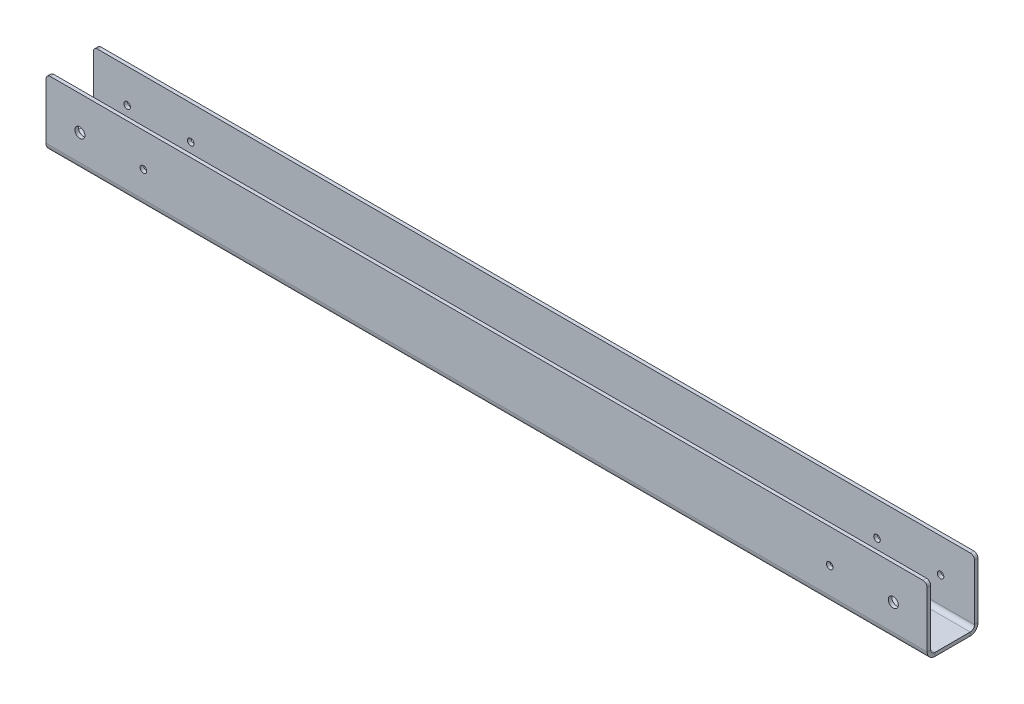
ISO-10303-21;
HEADER;
FILE_DESCRIPTION(('STEP AP214'),'2;1');
FILE_NAME('part.step','',(''),(''),'','','');
FILE_SCHEMA(('AUTOMOTIVE_DESIGN { 1 0 10303 214 1 1 1 1 }'));
ENDSEC;
DATA;
#1=APPLICATION_CONTEXT('core data for automotive mechanical design processes');
#2=APPLICATION_PROTOCOL_DEFINITION('international standard','automotive_design',2000,#1);
#3=PRODUCT_CONTEXT('',#1,'mechanical');
#4=PRODUCT('Part','Part','',(#3));
#5=PRODUCT_RELATED_PRODUCT_CATEGORY('part','',(#4));
#6=PRODUCT_DEFINITION_FORMATION('','',#4);
#7=PRODUCT_DEFINITION_CONTEXT('part definition',#1,'design');
#8=PRODUCT_DEFINITION('design','',#6,#7);
#9=PRODUCT_DEFINITION_SHAPE('','',#8);
#10=(LENGTH_UNIT() NAMED_UNIT(*) SI_UNIT(.MILLI.,.METRE.));
#11=(NAMED_UNIT(*) PLANE_ANGLE_UNIT() SI_UNIT($,.RADIAN.));
#12=(NAMED_UNIT(*) SI_UNIT($,.STERADIAN.) SOLID_ANGLE_UNIT());
#13=UNCERTAINTY_MEASURE_WITH_UNIT(LENGTH_MEASURE(1.E-05),#10,'distance_accuracy_value','');
#14=(GEOMETRIC_REPRESENTATION_CONTEXT(3) GLOBAL_UNCERTAINTY_ASSIGNED_CONTEXT((#13)) GLOBAL_UNIT_ASSIGNED_CONTEXT((#10,
#11,#12)) REPRESENTATION_CONTEXT('',''));
#15=CARTESIAN_POINT('',(0.,0.,0.));
#16=DIRECTION('',(0.,0.,1.));
#17=DIRECTION('',(1.,0.,0.));
#18=AXIS2_PLACEMENT_3D('',#15,#16,#17);
#19=CARTESIAN_POINT('',(0.,0.,-34.925));
#20=DIRECTION('',(0.,0.,1.));
#21=DIRECTION('',(1.,0.,0.));
#22=AXIS2_PLACEMENT_3D('',#19,#20,#21);
#23=PLANE('',#22);
#24=DIRECTION('',(1.,0.,0.));
#25=VECTOR('',#24,1.);
#26=CARTESIAN_POINT('',(706.12,48.14316,-34.925));
#27=LINE('',#26,#25);
#28=CARTESIAN_POINT('',(702.945,48.14316,-34.925));
#29=VERTEX_POINT('',#28);
#30=CARTESIAN_POINT('',(48.8950000000001,48.1431599999999,-34.925));
#31=VERTEX_POINT('',#30);
#32=EDGE_CURVE('E206',#29,#31,#27,.F.);
#33=ORIENTED_EDGE('',*,*,#32,.F.);
#34=CARTESIAN_POINT('',(702.945,44.96816,-34.925));
#35=DIRECTION('',(0.,0.,1.));
#36=DIRECTION('',(1.,0.,0.));
#37=AXIS2_PLACEMENT_3D('',#34,#35,#36);
#38=CIRCLE('',#37,3.175);
#39=CARTESIAN_POINT('',(706.12,44.96816,-34.925));
#40=VERTEX_POINT('',#39);
#41=EDGE_CURVE('E334',#29,#40,#38,.F.);
#42=ORIENTED_EDGE('',*,*,#41,.T.);
#43=DIRECTION('',(0.,-1.,0.));
#44=VECTOR('',#43,1.);
#45=CARTESIAN_POINT('',(706.12,0.,-34.925));
#46=LINE('',#45,#44);
#47=CARTESIAN_POINT('',(706.12,3.17499999999996,-34.925));
#48=VERTEX_POINT('',#47);
#49=EDGE_CURVE('E230',#48,#40,#46,.F.);
#50=ORIENTED_EDGE('',*,*,#49,.F.);
#51=DIRECTION('',(-1.,0.,0.));
#52=VECTOR('',#51,1.);
#53=CARTESIAN_POINT('',(706.12,3.17500000000001,-34.925));
#54=LINE('',#53,#52);
#55=CARTESIAN_POINT('',(45.72,3.175,-34.925));
#56=VERTEX_POINT('',#55);
#57=EDGE_CURVE('E214',#56,#48,#54,.F.);
#58=ORIENTED_EDGE('',*,*,#57,.F.);
#59=DIRECTION('',(0.,1.,0.));
#60=VECTOR('',#59,1.);
#61=CARTESIAN_POINT('',(45.72,48.1431599999999,-34.925));
#62=LINE('',#61,#60);
#63=CARTESIAN_POINT('',(45.72,44.9681599999999,-34.925));
#64=VERTEX_POINT('',#63);
#65=EDGE_CURVE('E195',#64,#56,#62,.F.);
#66=ORIENTED_EDGE('',*,*,#65,.F.);
#67=CARTESIAN_POINT('',(48.8950000000001,44.9681599999999,-34.925));
#68=DIRECTION('',(0.,0.,1.));
#69=DIRECTION('',(1.,0.,0.));
#70=AXIS2_PLACEMENT_3D('',#67,#68,#69);
#71=CIRCLE('',#70,3.175);
#72=EDGE_CURVE('E332',#64,#31,#71,.F.);
#73=ORIENTED_EDGE('',*,*,#72,.T.);
#74=EDGE_LOOP('',(#33,#42,#50,#58,#66,#73));
#75=FACE_BOUND('',#74,.T.);
#76=CARTESIAN_POINT('',(71.12,22.74316,-34.925));
#77=DIRECTION('',(0.,0.,-1.));
#78=DIRECTION('',(-1.,0.,0.));
#79=AXIS2_PLACEMENT_3D('',#76,#77,#78);
#80=CIRCLE('',#79,2.45744999999999);
#81=CARTESIAN_POINT('',(68.66255,22.74316,-34.925));
#82=VERTEX_POINT('',#81);
#83=EDGE_CURVE('E416',#82,#82,#80,.T.);
#84=ORIENTED_EDGE('',*,*,#83,.F.);
#85=EDGE_LOOP('',(#84));
#86=FACE_BOUND('',#85,.T.);
#87=CARTESIAN_POINT('',(118.745,22.74316,-34.925));
#88=DIRECTION('',(0.,0.,-1.));
#89=DIRECTION('',(-1.,0.,0.));
#90=AXIS2_PLACEMENT_3D('',#87,#88,#89);
#91=CIRCLE('',#90,2.45744999999999);
#92=CARTESIAN_POINT('',(116.28755,22.74316,-34.925));
#93=VERTEX_POINT('',#92);
#94=EDGE_CURVE('E422',#93,#93,#91,.T.);
#95=ORIENTED_EDGE('',*,*,#94,.F.);
#96=EDGE_LOOP('',(#95));
#97=FACE_BOUND('',#96,.T.);
#98=CARTESIAN_POINT('',(633.095,22.74316,-34.925));
#99=DIRECTION('',(0.,0.,-1.));
#100=DIRECTION('',(-1.,0.,0.));
#101=AXIS2_PLACEMENT_3D('',#98,#99,#100);
#102=CIRCLE('',#101,2.45744999999997);
#103=CARTESIAN_POINT('',(630.63755,22.74316,-34.925));
#104=VERTEX_POINT('',#103);
#105=EDGE_CURVE('E428',#104,#104,#102,.T.);
#106=ORIENTED_EDGE('',*,*,#105,.F.);
#107=EDGE_LOOP('',(#106));
#108=FACE_BOUND('',#107,.T.);
#109=CARTESIAN_POINT('',(680.72,22.74316,-34.925));
#110=DIRECTION('',(0.,0.,-1.));
#111=DIRECTION('',(-1.,0.,0.));
#112=AXIS2_PLACEMENT_3D('',#109,#110,#111);
#113=CIRCLE('',#112,2.45744999999997);
#114=CARTESIAN_POINT('',(678.26255,22.74316,-34.925));
#115=VERTEX_POINT('',#114);
#116=EDGE_CURVE('E434',#115,#115,#113,.T.);
#117=ORIENTED_EDGE('',*,*,#116,.F.);
#118=EDGE_LOOP('',(#117));
#119=FACE_BOUND('',#118,.T.);
#120=ADVANCED_FACE('F79',(#75,#86,#97,#108,#119),#23,.F.);
#121=CARTESIAN_POINT('',(0.,-2.65684,0.));
#122=DIRECTION('',(0.,1.,0.));
#123=DIRECTION('',(0.,0.,1.));
#124=AXIS2_PLACEMENT_3D('',#121,#122,#123);
#125=PLANE('',#124);
#126=DIRECTION('',(-1.,0.,0.));
#127=VECTOR('',#126,1.);
#128=CARTESIAN_POINT('',(45.72,-2.65684000000004,-29.09316));
#129=LINE('',#128,#127);
#130=CARTESIAN_POINT('',(45.72,-2.65684000000004,-29.09316));
#131=VERTEX_POINT('',#130);
#132=CARTESIAN_POINT('',(706.12,-2.65684,-29.09316));
#133=VERTEX_POINT('',#132);
#134=EDGE_CURVE('E216',#131,#133,#129,.F.);
#135=ORIENTED_EDGE('',*,*,#134,.T.);
#136=DIRECTION('',(0.,0.,-1.));
#137=VECTOR('',#136,1.);
#138=CARTESIAN_POINT('',(706.12,-2.65684,-34.925));
#139=LINE('',#138,#137);
#140=CARTESIAN_POINT('',(706.12,-2.65684000000007,-2.65684000000003));
#141=VERTEX_POINT('',#140);
#142=EDGE_CURVE('E311',#141,#133,#139,.T.);
#143=ORIENTED_EDGE('',*,*,#142,.F.);
#144=DIRECTION('',(1.,0.,0.));
#145=VECTOR('',#144,1.);
#146=CARTESIAN_POINT('',(706.12,-2.65684000000007,-2.65684000000003));
#147=LINE('',#146,#145);
#148=CARTESIAN_POINT('',(45.72,-2.65684,-2.65684000000008));
#149=VERTEX_POINT('',#148);
#150=EDGE_CURVE('E287',#141,#149,#147,.F.);
#151=ORIENTED_EDGE('',*,*,#150,.T.);
#152=DIRECTION('',(0.,0.,1.));
#153=VECTOR('',#152,1.);
#154=CARTESIAN_POINT('',(45.72,-2.65684,-34.925));
#155=LINE('',#154,#153);
#156=EDGE_CURVE('E314',#131,#149,#155,.T.);
#157=ORIENTED_EDGE('',*,*,#156,.F.);
#158=EDGE_LOOP('',(#135,#143,#151,#157));
#159=FACE_BOUND('',#158,.T.);
#160=ADVANCED_FACE('F490',(#159),#125,.F.);
#161=CARTESIAN_POINT('',(0.,0.,0.));
#162=DIRECTION('',(0.,1.,0.));
#163=DIRECTION('',(0.,0.,1.));
#164=AXIS2_PLACEMENT_3D('',#161,#162,#163);
#165=PLANE('',#164);
#166=DIRECTION('',(0.,0.,-1.));
#167=VECTOR('',#166,1.);
#168=CARTESIAN_POINT('',(706.12,0.,-34.925));
#169=LINE('',#168,#167);
#170=CARTESIAN_POINT('',(706.12,0.,-2.65684000000004));
#171=VERTEX_POINT('',#170);
#172=CARTESIAN_POINT('',(706.12,0.,-29.09316));
#173=VERTEX_POINT('',#172);
#174=EDGE_CURVE('E308',#171,#173,#169,.T.);
#175=ORIENTED_EDGE('',*,*,#174,.T.);
#176=DIRECTION('',(-1.,0.,0.));
#177=VECTOR('',#176,1.);
#178=CARTESIAN_POINT('',(45.72,0.,-29.09316));
#179=LINE('',#178,#177);
#180=CARTESIAN_POINT('',(45.72,0.,-29.09316));
#181=VERTEX_POINT('',#180);
#182=EDGE_CURVE('E250',#181,#173,#179,.F.);
#183=ORIENTED_EDGE('',*,*,#182,.F.);
#184=DIRECTION('',(0.,0.,1.));
#185=VECTOR('',#184,1.);
#186=CARTESIAN_POINT('',(45.72,0.,-34.925));
#187=LINE('',#186,#185);
#188=CARTESIAN_POINT('',(45.72,0.,-2.65684000000008));
#189=VERTEX_POINT('',#188);
#190=EDGE_CURVE('E315',#181,#189,#187,.T.);
#191=ORIENTED_EDGE('',*,*,#190,.T.);
#192=DIRECTION('',(1.,0.,0.));
#193=VECTOR('',#192,1.);
#194=CARTESIAN_POINT('',(706.12,0.,-2.65683999999999));
#195=LINE('',#194,#193);
#196=EDGE_CURVE('E300',#171,#189,#195,.F.);
#197=ORIENTED_EDGE('',*,*,#196,.F.);
#198=EDGE_LOOP('',(#175,#183,#191,#197));
#199=FACE_BOUND('',#198,.T.);
#200=ADVANCED_FACE('F383',(#199),#165,.T.);
#201=CARTESIAN_POINT('',(45.72,-2.65684,-34.925));
#202=DIRECTION('',(-1.,0.,0.));
#203=DIRECTION('',(0.,0.,1.));
#204=AXIS2_PLACEMENT_3D('',#201,#202,#203);
#205=PLANE('',#204);
#206=ORIENTED_EDGE('',*,*,#190,.F.);
#207=DIRECTION('',(0.,-1.,0.));
#208=VECTOR('',#207,1.);
#209=CARTESIAN_POINT('',(45.72,0.,-29.09316));
#210=LINE('',#209,#208);
#211=EDGE_CURVE('E246',#181,#131,#210,.T.);
#212=ORIENTED_EDGE('',*,*,#211,.T.);
#213=ORIENTED_EDGE('',*,*,#156,.T.);
#214=DIRECTION('',(0.,-1.,0.));
#215=VECTOR('',#214,1.);
#216=CARTESIAN_POINT('',(45.72,0.,-2.65684000000008));
#217=LINE('',#216,#215);
#218=EDGE_CURVE('E305',#189,#149,#217,.T.);
#219=ORIENTED_EDGE('',*,*,#218,.F.);
#220=EDGE_LOOP('',(#206,#212,#213,#219));
#221=FACE_BOUND('',#220,.T.);
#222=ADVANCED_FACE('F537',(#221),#205,.T.);
#223=CARTESIAN_POINT('',(706.12,-2.65684,-34.925));
#224=DIRECTION('',(1.,0.,0.));
#225=DIRECTION('',(0.,0.,-1.));
#226=AXIS2_PLACEMENT_3D('',#223,#224,#225);
#227=PLANE('',#226);
#228=DIRECTION('',(0.,-1.,0.));
#229=VECTOR('',#228,1.);
#230=CARTESIAN_POINT('',(706.12,0.,-29.09316));
#231=LINE('',#230,#229);
#232=EDGE_CURVE('E254',#173,#133,#231,.T.);
#233=ORIENTED_EDGE('',*,*,#232,.F.);
#234=ORIENTED_EDGE('',*,*,#174,.F.);
#235=DIRECTION('',(0.,-1.,0.));
#236=VECTOR('',#235,1.);
#237=CARTESIAN_POINT('',(706.12,0.,-2.65683999999999));
#238=LINE('',#237,#236);
#239=EDGE_CURVE('E294',#171,#141,#238,.T.);
#240=ORIENTED_EDGE('',*,*,#239,.T.);
#241=ORIENTED_EDGE('',*,*,#142,.T.);
#242=EDGE_LOOP('',(#233,#234,#240,#241));
#243=FACE_BOUND('',#242,.T.);
#244=ADVANCED_FACE('F386',(#243),#227,.T.);
#245=CARTESIAN_POINT('',(45.72,3.17499999999998,-2.65684000000004));
#246=DIRECTION('',(-1.,0.,0.));
#247=DIRECTION('',(0.,0.,1.));
#248=AXIS2_PLACEMENT_3D('',#245,#246,#247);
#249=PLANE('',#248);
#250=DIRECTION('',(0.,0.,1.));
#251=VECTOR('',#250,1.);
#252=CARTESIAN_POINT('',(45.72,3.175,3.17500000000017));
#253=LINE('',#252,#251);
#254=CARTESIAN_POINT('',(45.72,3.17499999999997,0.518160000000011));
#255=VERTEX_POINT('',#254);
#256=CARTESIAN_POINT('',(45.72,3.17499999999996,3.17500000000001));
#257=VERTEX_POINT('',#256);
#258=EDGE_CURVE('E257',#255,#257,#253,.T.);
#259=ORIENTED_EDGE('',*,*,#258,.F.);
#260=CARTESIAN_POINT('',(45.72,3.17499999999998,-2.65684000000004));
#261=DIRECTION('',(1.,0.,0.));
#262=DIRECTION('',(0.,0.,-1.));
#263=AXIS2_PLACEMENT_3D('',#260,#261,#262);
#264=CIRCLE('',#263,3.17500000000005);
#265=EDGE_CURVE('E297',#189,#255,#264,.F.);
#266=ORIENTED_EDGE('',*,*,#265,.F.);
#267=ORIENTED_EDGE('',*,*,#218,.T.);
#268=CARTESIAN_POINT('',(45.72,3.17499999999998,-2.65684000000004));
#269=DIRECTION('',(1.,0.,0.));
#270=DIRECTION('',(0.,0.,-1.));
#271=AXIS2_PLACEMENT_3D('',#268,#269,#270);
#272=CIRCLE('',#271,5.83184000000005);
#273=EDGE_CURVE('E290',#149,#257,#272,.F.);
#274=ORIENTED_EDGE('',*,*,#273,.T.);
#275=EDGE_LOOP('',(#259,#266,#267,#274));
#276=FACE_BOUND('',#275,.T.);
#277=ADVANCED_FACE('F372',(#276),#249,.T.);
#278=CARTESIAN_POINT('',(706.12,3.17499999999998,-2.65683999999995));
#279=DIRECTION('',(-1.,0.,0.));
#280=DIRECTION('',(0.,0.,1.));
#281=AXIS2_PLACEMENT_3D('',#278,#279,#280);
#282=PLANE('',#281);
#283=CARTESIAN_POINT('',(706.12,3.17499999999998,-2.65683999999995));
#284=DIRECTION('',(1.,0.,0.));
#285=DIRECTION('',(0.,0.,-1.));
#286=AXIS2_PLACEMENT_3D('',#283,#284,#285);
#287=CIRCLE('',#286,3.17500000000005);
#288=CARTESIAN_POINT('',(706.12,3.17499999999997,0.518160000000102));
#289=VERTEX_POINT('',#288);
#290=EDGE_CURVE('E262',#289,#171,#287,.T.);
#291=ORIENTED_EDGE('',*,*,#290,.F.);
#292=DIRECTION('',(0.,0.,1.));
#293=VECTOR('',#292,1.);
#294=CARTESIAN_POINT('',(706.12,3.17499999999997,0.518160000000009));
#295=LINE('',#294,#293);
#296=CARTESIAN_POINT('',(706.12,3.17499999999997,3.17500000000001));
#297=VERTEX_POINT('',#296);
#298=EDGE_CURVE('E279',#289,#297,#295,.T.);
#299=ORIENTED_EDGE('',*,*,#298,.T.);
#300=CARTESIAN_POINT('',(706.12,3.17499999999998,-2.65683999999995));
#301=DIRECTION('',(1.,0.,0.));
#302=DIRECTION('',(0.,0.,-1.));
#303=AXIS2_PLACEMENT_3D('',#300,#301,#302);
#304=CIRCLE('',#303,5.83184000000005);
#305=EDGE_CURVE('E291',#297,#141,#304,.T.);
#306=ORIENTED_EDGE('',*,*,#305,.T.);
#307=ORIENTED_EDGE('',*,*,#239,.F.);
#308=EDGE_LOOP('',(#291,#299,#306,#307));
#309=FACE_BOUND('',#308,.T.);
#310=ADVANCED_FACE('F365',(#309),#282,.F.);
#311=CARTESIAN_POINT('',(706.12,3.17499999999998,-2.65683999999995));
#312=DIRECTION('',(1.,0.,0.));
#313=DIRECTION('',(0.,0.,1.));
#314=AXIS2_PLACEMENT_3D('',#311,#312,#313);
#315=CYLINDRICAL_SURFACE('',#314,5.83184000000005);
#316=ORIENTED_EDGE('',*,*,#150,.F.);
#317=ORIENTED_EDGE('',*,*,#305,.F.);
#318=DIRECTION('',(1.,0.,0.));
#319=VECTOR('',#318,1.);
#320=CARTESIAN_POINT('',(0.,3.17499999999999,3.17500000000001));
#321=LINE('',#320,#319);
#322=EDGE_CURVE('E276',#257,#297,#321,.T.);
#323=ORIENTED_EDGE('',*,*,#322,.F.);
#324=ORIENTED_EDGE('',*,*,#273,.F.);
#325=EDGE_LOOP('',(#316,#317,#323,#324));
#326=FACE_BOUND('',#325,.T.);
#327=ADVANCED_FACE('F370',(#326),#315,.T.);
#328=CARTESIAN_POINT('',(706.12,3.17499999999998,-2.65683999999995));
#329=DIRECTION('',(1.,0.,0.));
#330=DIRECTION('',(0.,0.,1.));
#331=AXIS2_PLACEMENT_3D('',#328,#329,#330);
#332=CYLINDRICAL_SURFACE('',#331,3.17500000000005);
#333=ORIENTED_EDGE('',*,*,#196,.T.);
#334=ORIENTED_EDGE('',*,*,#265,.T.);
#335=DIRECTION('',(-1.,0.,0.));
#336=VECTOR('',#335,1.);
#337=CARTESIAN_POINT('',(45.72,3.17499999999999,0.518160000000012));
#338=LINE('',#337,#336);
#339=EDGE_CURVE('E282',#255,#289,#338,.F.);
#340=ORIENTED_EDGE('',*,*,#339,.T.);
#341=ORIENTED_EDGE('',*,*,#290,.T.);
#342=EDGE_LOOP('',(#333,#334,#340,#341));
#343=FACE_BOUND('',#342,.T.);
#344=ADVANCED_FACE('F380',(#343),#332,.F.);
#345=CARTESIAN_POINT('',(706.12,0.,3.175));
#346=DIRECTION('',(1.,0.,0.));
#347=DIRECTION('',(0.,0.,-1.));
#348=AXIS2_PLACEMENT_3D('',#345,#346,#347);
#349=PLANE('',#348);
#350=DIRECTION('',(0.,1.,0.));
#351=VECTOR('',#350,1.);
#352=CARTESIAN_POINT('',(706.12,0.,0.518159999999997));
#353=LINE('',#352,#351);
#354=CARTESIAN_POINT('',(706.12,44.96816,0.518160000000154));
#355=VERTEX_POINT('',#354);
#356=EDGE_CURVE('E268',#355,#289,#353,.F.);
#357=ORIENTED_EDGE('',*,*,#356,.F.);
#358=DIRECTION('',(0.,0.,-1.));
#359=VECTOR('',#358,1.);
#360=CARTESIAN_POINT('',(706.12,44.96816,3.17500000000015));
#361=LINE('',#360,#359);
#362=CARTESIAN_POINT('',(706.12,44.96816,3.17500000000015));
#363=VERTEX_POINT('',#362);
#364=EDGE_CURVE('E102',#355,#363,#361,.F.);
#365=ORIENTED_EDGE('',*,*,#364,.T.);
#366=DIRECTION('',(0.,-1.,0.));
#367=VECTOR('',#366,1.);
#368=CARTESIAN_POINT('',(706.12,0.,3.175));
#369=LINE('',#368,#367);
#370=EDGE_CURVE('E260',#363,#297,#369,.T.);
#371=ORIENTED_EDGE('',*,*,#370,.T.);
#372=ORIENTED_EDGE('',*,*,#298,.F.);
#373=EDGE_LOOP('',(#357,#365,#371,#372));
#374=FACE_BOUND('',#373,.T.);
#375=ADVANCED_FACE('F361',(#374),#349,.T.);
#376=CARTESIAN_POINT('',(45.72,48.14316,3.17500000000017));
#377=DIRECTION('',(-1.,0.,0.));
#378=DIRECTION('',(0.,-1.,0.));
#379=AXIS2_PLACEMENT_3D('',#376,#377,#378);
#380=PLANE('',#379);
#381=DIRECTION('',(0.,1.,0.));
#382=VECTOR('',#381,1.);
#383=CARTESIAN_POINT('',(45.72,48.14316,3.17500000000017));
#384=LINE('',#383,#382);
#385=CARTESIAN_POINT('',(45.72,44.96816,3.17500000000016));
#386=VERTEX_POINT('',#385);
#387=EDGE_CURVE('E266',#257,#386,#384,.T.);
#388=ORIENTED_EDGE('',*,*,#387,.T.);
#389=DIRECTION('',(0.,0.,-1.));
#390=VECTOR('',#389,1.);
#391=CARTESIAN_POINT('',(45.72,44.96816,3.17500000000016));
#392=LINE('',#391,#390);
#393=CARTESIAN_POINT('',(45.72,44.96816,0.518160000000157));
#394=VERTEX_POINT('',#393);
#395=EDGE_CURVE('E13',#386,#394,#392,.T.);
#396=ORIENTED_EDGE('',*,*,#395,.T.);
#397=DIRECTION('',(0.,-1.,0.));
#398=VECTOR('',#397,1.);
#399=CARTESIAN_POINT('',(45.72,0.,0.51816));
#400=LINE('',#399,#398);
#401=EDGE_CURVE('E273',#255,#394,#400,.F.);
#402=ORIENTED_EDGE('',*,*,#401,.F.);
#403=ORIENTED_EDGE('',*,*,#258,.T.);
#404=EDGE_LOOP('',(#388,#396,#402,#403));
#405=FACE_BOUND('',#404,.T.);
#406=ADVANCED_FACE('F377',(#405),#380,.T.);
#407=CARTESIAN_POINT('',(0.,0.,3.175));
#408=DIRECTION('',(0.,0.,1.));
#409=DIRECTION('',(0.,-1.,0.));
#410=AXIS2_PLACEMENT_3D('',#407,#408,#409);
#411=PLANE('',#410);
#412=CARTESIAN_POINT('',(71.12,22.74316,3.175));
#413=DIRECTION('',(0.,0.,1.));
#414=DIRECTION('',(1.,0.,0.));
#415=AXIS2_PLACEMENT_3D('',#412,#413,#414);
#416=CIRCLE('',#415,3.77037599999999);
#417=CARTESIAN_POINT('',(74.890376,22.74316,3.175));
#418=VERTEX_POINT('',#417);
#419=EDGE_CURVE('E458',#418,#418,#416,.T.);
#420=ORIENTED_EDGE('',*,*,#419,.F.);
#421=EDGE_LOOP('',(#420));
#422=FACE_BOUND('',#421,.T.);
#423=CARTESIAN_POINT('',(680.72,22.74316,3.175));
#424=DIRECTION('',(0.,0.,1.));
#425=DIRECTION('',(1.,0.,0.));
#426=AXIS2_PLACEMENT_3D('',#423,#424,#425);
#427=CIRCLE('',#426,3.77037599999996);
#428=CARTESIAN_POINT('',(684.490376,22.74316,3.175));
#429=VERTEX_POINT('',#428);
#430=EDGE_CURVE('E452',#429,#429,#427,.T.);
#431=ORIENTED_EDGE('',*,*,#430,.F.);
#432=EDGE_LOOP('',(#431));
#433=FACE_BOUND('',#432,.T.);
#434=CARTESIAN_POINT('',(118.745,22.74316,3.175));
#435=DIRECTION('',(0.,0.,1.));
#436=DIRECTION('',(1.,0.,0.));
#437=AXIS2_PLACEMENT_3D('',#434,#435,#436);
#438=CIRCLE('',#437,2.45744999999999);
#439=CARTESIAN_POINT('',(121.20245,22.74316,3.175));
#440=VERTEX_POINT('',#439);
#441=EDGE_CURVE('E446',#440,#440,#438,.T.);
#442=ORIENTED_EDGE('',*,*,#441,.F.);
#443=EDGE_LOOP('',(#442));
#444=FACE_BOUND('',#443,.T.);
#445=CARTESIAN_POINT('',(633.095,22.74316,3.175));
#446=DIRECTION('',(0.,0.,1.));
#447=DIRECTION('',(1.,0.,0.));
#448=AXIS2_PLACEMENT_3D('',#445,#446,#447);
#449=CIRCLE('',#448,2.45744999999997);
#450=CARTESIAN_POINT('',(635.55245,22.74316,3.175));
#451=VERTEX_POINT('',#450);
#452=EDGE_CURVE('E440',#451,#451,#449,.T.);
#453=ORIENTED_EDGE('',*,*,#452,.F.);
#454=EDGE_LOOP('',(#453));
#455=FACE_BOUND('',#454,.T.);
#456=ORIENTED_EDGE('',*,*,#370,.F.);
#457=CARTESIAN_POINT('',(702.945,44.96816,3.17500000000015));
#458=DIRECTION('',(0.,0.,1.));
#459=DIRECTION('',(0.,-1.,0.));
#460=AXIS2_PLACEMENT_3D('',#457,#458,#459);
#461=CIRCLE('',#460,3.175);
#462=CARTESIAN_POINT('',(702.945,48.14316,3.17500000000016));
#463=VERTEX_POINT('',#462);
#464=EDGE_CURVE('E347',#363,#463,#461,.T.);
#465=ORIENTED_EDGE('',*,*,#464,.T.);
#466=DIRECTION('',(1.,0.,0.));
#467=VECTOR('',#466,1.);
#468=CARTESIAN_POINT('',(706.12,48.14316,3.17500000000016));
#469=LINE('',#468,#467);
#470=CARTESIAN_POINT('',(48.895,48.14316,3.17500000000017));
#471=VERTEX_POINT('',#470);
#472=EDGE_CURVE('E263',#471,#463,#469,.T.);
#473=ORIENTED_EDGE('',*,*,#472,.F.);
#474=CARTESIAN_POINT('',(48.895,44.96816,3.17500000000016));
#475=DIRECTION('',(0.,0.,1.));
#476=DIRECTION('',(0.,-1.,0.));
#477=AXIS2_PLACEMENT_3D('',#474,#475,#476);
#478=CIRCLE('',#477,3.175);
#479=EDGE_CURVE('E94',#471,#386,#478,.T.);
#480=ORIENTED_EDGE('',*,*,#479,.T.);
#481=ORIENTED_EDGE('',*,*,#387,.F.);
#482=ORIENTED_EDGE('',*,*,#322,.T.);
#483=EDGE_LOOP('',(#456,#465,#473,#480,#481,#482));
#484=FACE_BOUND('',#483,.T.);
#485=ADVANCED_FACE('F349',(#422,#433,#444,#455,#484),#411,.T.);
#486=CARTESIAN_POINT('',(0.,0.,0.518160000000001));
#487=DIRECTION('',(0.,0.,1.));
#488=DIRECTION('',(0.,-1.,0.));
#489=AXIS2_PLACEMENT_3D('',#486,#487,#488);
#490=PLANE('',#489);
#491=CARTESIAN_POINT('',(71.12,22.74316,0.51816000000008));
#492=DIRECTION('',(0.,0.,1.));
#493=DIRECTION('',(0.,-1.,0.));
#494=AXIS2_PLACEMENT_3D('',#491,#492,#493);
#495=CIRCLE('',#494,3.770376);
#496=CARTESIAN_POINT('',(71.12,18.972784,0.518160000000066));
#497=VERTEX_POINT('',#496);
#498=EDGE_CURVE('E455',#497,#497,#495,.T.);
#499=ORIENTED_EDGE('',*,*,#498,.T.);
#500=EDGE_LOOP('',(#499));
#501=FACE_BOUND('',#500,.T.);
#502=CARTESIAN_POINT('',(680.72,22.74316,0.518160000000077));
#503=DIRECTION('',(0.,0.,1.));
#504=DIRECTION('',(0.,-1.,0.));
#505=AXIS2_PLACEMENT_3D('',#502,#503,#504);
#506=CIRCLE('',#505,3.77037599999996);
#507=CARTESIAN_POINT('',(680.72,18.972784,0.518160000000064));
#508=VERTEX_POINT('',#507);
#509=EDGE_CURVE('E449',#508,#508,#506,.T.);
#510=ORIENTED_EDGE('',*,*,#509,.T.);
#511=EDGE_LOOP('',(#510));
#512=FACE_BOUND('',#511,.T.);
#513=CARTESIAN_POINT('',(118.745,22.74316,0.51816000000008));
#514=DIRECTION('',(0.,0.,1.));
#515=DIRECTION('',(0.,-1.,0.));
#516=AXIS2_PLACEMENT_3D('',#513,#514,#515);
#517=CIRCLE('',#516,2.45744999999999);
#518=CARTESIAN_POINT('',(118.745,20.28571,0.518160000000071));
#519=VERTEX_POINT('',#518);
#520=EDGE_CURVE('E443',#519,#519,#517,.T.);
#521=ORIENTED_EDGE('',*,*,#520,.T.);
#522=EDGE_LOOP('',(#521));
#523=FACE_BOUND('',#522,.T.);
#524=CARTESIAN_POINT('',(633.095,22.74316,0.518160000000077));
#525=DIRECTION('',(0.,0.,1.));
#526=DIRECTION('',(0.,-1.,0.));
#527=AXIS2_PLACEMENT_3D('',#524,#525,#526);
#528=CIRCLE('',#527,2.45744999999997);
#529=CARTESIAN_POINT('',(633.095,20.28571,0.518160000000068));
#530=VERTEX_POINT('',#529);
#531=EDGE_CURVE('E437',#530,#530,#528,.T.);
#532=ORIENTED_EDGE('',*,*,#531,.T.);
#533=EDGE_LOOP('',(#532));
#534=FACE_BOUND('',#533,.T.);
#535=DIRECTION('',(-1.,0.,0.));
#536=VECTOR('',#535,1.);
#537=CARTESIAN_POINT('',(0.,48.14316,0.518160000000168));
#538=LINE('',#537,#536);
#539=CARTESIAN_POINT('',(48.895,48.14316,0.518160000000168));
#540=VERTEX_POINT('',#539);
#541=CARTESIAN_POINT('',(702.945,48.14316,0.518160000000165));
#542=VERTEX_POINT('',#541);
#543=EDGE_CURVE('E270',#540,#542,#538,.F.);
#544=ORIENTED_EDGE('',*,*,#543,.T.);
#545=CARTESIAN_POINT('',(702.945,44.96816,0.518160000000154));
#546=DIRECTION('',(0.,0.,1.));
#547=DIRECTION('',(0.,-1.,0.));
#548=AXIS2_PLACEMENT_3D('',#545,#546,#547);
#549=CIRCLE('',#548,3.175);
#550=EDGE_CURVE('E343',#542,#355,#549,.F.);
#551=ORIENTED_EDGE('',*,*,#550,.T.);
#552=ORIENTED_EDGE('',*,*,#356,.T.);
#553=ORIENTED_EDGE('',*,*,#339,.F.);
#554=ORIENTED_EDGE('',*,*,#401,.T.);
#555=CARTESIAN_POINT('',(48.895,44.96816,0.518160000000157));
#556=DIRECTION('',(0.,0.,1.));
#557=DIRECTION('',(0.,-1.,0.));
#558=AXIS2_PLACEMENT_3D('',#555,#556,#557);
#559=CIRCLE('',#558,3.175);
#560=EDGE_CURVE('E341',#394,#540,#559,.F.);
#561=ORIENTED_EDGE('',*,*,#560,.T.);
#562=EDGE_LOOP('',(#544,#551,#552,#553,#554,#561));
#563=FACE_BOUND('',#562,.T.);
#564=ADVANCED_FACE('F358',(#501,#512,#523,#534,#563),#490,.F.);
#565=CARTESIAN_POINT('',(706.12,48.14316,3.17500000000016));
#566=DIRECTION('',(0.,1.,0.));
#567=DIRECTION('',(0.,0.,1.));
#568=AXIS2_PLACEMENT_3D('',#565,#566,#567);
#569=PLANE('',#568);
#570=ORIENTED_EDGE('',*,*,#472,.T.);
#571=DIRECTION('',(0.,0.,-1.));
#572=VECTOR('',#571,1.);
#573=CARTESIAN_POINT('',(702.945,48.14316,3.17500000000016));
#574=LINE('',#573,#572);
#575=EDGE_CURVE('E338',#463,#542,#574,.T.);
#576=ORIENTED_EDGE('',*,*,#575,.T.);
#577=ORIENTED_EDGE('',*,*,#543,.F.);
#578=DIRECTION('',(0.,0.,-1.));
#579=VECTOR('',#578,1.);
#580=CARTESIAN_POINT('',(48.895,48.14316,3.17500000000017));
#581=LINE('',#580,#579);
#582=EDGE_CURVE('E336',#540,#471,#581,.F.);
#583=ORIENTED_EDGE('',*,*,#582,.T.);
#584=EDGE_LOOP('',(#570,#576,#577,#583));
#585=FACE_BOUND('',#584,.T.);
#586=ADVANCED_FACE('F353',(#585),#569,.T.);
#587=CARTESIAN_POINT('',(706.12,3.17499999999996,-29.09316));
#588=DIRECTION('',(1.,0.,0.));
#589=DIRECTION('',(0.,0.,-1.));
#590=AXIS2_PLACEMENT_3D('',#587,#588,#589);
#591=PLANE('',#590);
#592=DIRECTION('',(0.,0.,-1.));
#593=VECTOR('',#592,1.);
#594=CARTESIAN_POINT('',(706.12,3.17500000000001,-34.925));
#595=LINE('',#594,#593);
#596=CARTESIAN_POINT('',(706.12,3.17499999999996,-32.26816));
#597=VERTEX_POINT('',#596);
#598=EDGE_CURVE('E240',#597,#48,#595,.T.);
#599=ORIENTED_EDGE('',*,*,#598,.F.);
#600=CARTESIAN_POINT('',(706.12,3.17499999999996,-29.09316));
#601=DIRECTION('',(-1.,0.,0.));
#602=DIRECTION('',(0.,0.,1.));
#603=AXIS2_PLACEMENT_3D('',#600,#601,#602);
#604=CIRCLE('',#603,3.175);
#605=EDGE_CURVE('E219',#173,#597,#604,.F.);
#606=ORIENTED_EDGE('',*,*,#605,.F.);
#607=ORIENTED_EDGE('',*,*,#232,.T.);
#608=CARTESIAN_POINT('',(706.12,3.17499999999996,-29.09316));
#609=DIRECTION('',(-1.,0.,0.));
#610=DIRECTION('',(0.,0.,1.));
#611=AXIS2_PLACEMENT_3D('',#608,#609,#610);
#612=CIRCLE('',#611,5.83184);
#613=EDGE_CURVE('E245',#133,#48,#612,.F.);
#614=ORIENTED_EDGE('',*,*,#613,.T.);
#615=EDGE_LOOP('',(#599,#606,#607,#614));
#616=FACE_BOUND('',#615,.T.);
#617=ADVANCED_FACE('F389',(#616),#591,.T.);
#618=CARTESIAN_POINT('',(45.72,3.17499999999996,-29.09316));
#619=DIRECTION('',(1.,0.,0.));
#620=DIRECTION('',(0.,0.,-1.));
#621=AXIS2_PLACEMENT_3D('',#618,#619,#620);
#622=PLANE('',#621);
#623=CARTESIAN_POINT('',(45.72,3.17499999999996,-29.09316));
#624=DIRECTION('',(-1.,0.,0.));
#625=DIRECTION('',(0.,0.,1.));
#626=AXIS2_PLACEMENT_3D('',#623,#624,#625);
#627=CIRCLE('',#626,3.175);
#628=CARTESIAN_POINT('',(45.72,3.17499999999996,-32.26816));
#629=VERTEX_POINT('',#628);
#630=EDGE_CURVE('E205',#629,#181,#627,.T.);
#631=ORIENTED_EDGE('',*,*,#630,.F.);
#632=DIRECTION('',(0.,0.,-1.));
#633=VECTOR('',#632,1.);
#634=CARTESIAN_POINT('',(45.7200000000001,3.17499999999998,-32.26816));
#635=LINE('',#634,#633);
#636=EDGE_CURVE('E200',#629,#56,#635,.T.);
#637=ORIENTED_EDGE('',*,*,#636,.T.);
#638=CARTESIAN_POINT('',(45.72,3.17499999999996,-29.09316));
#639=DIRECTION('',(-1.,0.,0.));
#640=DIRECTION('',(0.,0.,1.));
#641=AXIS2_PLACEMENT_3D('',#638,#639,#640);
#642=CIRCLE('',#641,5.83184);
#643=EDGE_CURVE('E211',#56,#131,#642,.T.);
#644=ORIENTED_EDGE('',*,*,#643,.T.);
#645=ORIENTED_EDGE('',*,*,#211,.F.);
#646=EDGE_LOOP('',(#631,#637,#644,#645));
#647=FACE_BOUND('',#646,.T.);
#648=ADVANCED_FACE('F222',(#647),#622,.F.);
#649=CARTESIAN_POINT('',(45.72,3.17499999999996,-29.09316));
#650=DIRECTION('',(-1.,0.,0.));
#651=DIRECTION('',(0.,0.,-1.));
#652=AXIS2_PLACEMENT_3D('',#649,#650,#651);
#653=CYLINDRICAL_SURFACE('',#652,5.83184);
#654=ORIENTED_EDGE('',*,*,#134,.F.);
#655=ORIENTED_EDGE('',*,*,#643,.F.);
#656=ORIENTED_EDGE('',*,*,#57,.T.);
#657=ORIENTED_EDGE('',*,*,#613,.F.);
#658=EDGE_LOOP('',(#654,#655,#656,#657));
#659=FACE_BOUND('',#658,.T.);
#660=ADVANCED_FACE('F212',(#659),#653,.T.);
#661=CARTESIAN_POINT('',(45.72,3.17499999999996,-29.09316));
#662=DIRECTION('',(-1.,0.,0.));
#663=DIRECTION('',(0.,0.,-1.));
#664=AXIS2_PLACEMENT_3D('',#661,#662,#663);
#665=CYLINDRICAL_SURFACE('',#664,3.175);
#666=ORIENTED_EDGE('',*,*,#182,.T.);
#667=ORIENTED_EDGE('',*,*,#605,.T.);
#668=DIRECTION('',(-1.,0.,0.));
#669=VECTOR('',#668,1.);
#670=CARTESIAN_POINT('',(706.12,3.17499999999999,-32.26816));
#671=LINE('',#670,#669);
#672=EDGE_CURVE('E224',#597,#629,#671,.T.);
#673=ORIENTED_EDGE('',*,*,#672,.T.);
#674=ORIENTED_EDGE('',*,*,#630,.T.);
#675=EDGE_LOOP('',(#666,#667,#673,#674));
#676=FACE_BOUND('',#675,.T.);
#677=ADVANCED_FACE('F392',(#676),#665,.F.);
#678=CARTESIAN_POINT('',(706.12,0.,-34.925));
#679=DIRECTION('',(1.,0.,0.));
#680=DIRECTION('',(0.,0.,-1.));
#681=AXIS2_PLACEMENT_3D('',#678,#679,#680);
#682=PLANE('',#681);
#683=ORIENTED_EDGE('',*,*,#49,.T.);
#684=DIRECTION('',(0.,0.,1.));
#685=VECTOR('',#684,1.);
#686=CARTESIAN_POINT('',(706.12,44.96816,-34.925));
#687=LINE('',#686,#685);
#688=CARTESIAN_POINT('',(706.12,44.96816,-32.26816));
#689=VERTEX_POINT('',#688);
#690=EDGE_CURVE('E317',#40,#689,#687,.T.);
#691=ORIENTED_EDGE('',*,*,#690,.T.);
#692=DIRECTION('',(0.,1.,0.));
#693=VECTOR('',#692,1.);
#694=CARTESIAN_POINT('',(706.12,0.,-32.26816));
#695=LINE('',#694,#693);
#696=EDGE_CURVE('E231',#597,#689,#695,.T.);
#697=ORIENTED_EDGE('',*,*,#696,.F.);
#698=ORIENTED_EDGE('',*,*,#598,.T.);
#699=EDGE_LOOP('',(#683,#691,#697,#698));
#700=FACE_BOUND('',#699,.T.);
#701=ADVANCED_FACE('F398',(#700),#682,.T.);
#702=CARTESIAN_POINT('',(45.72,48.1431599999999,-34.925));
#703=DIRECTION('',(-1.,0.,0.));
#704=DIRECTION('',(0.,-1.,0.));
#705=AXIS2_PLACEMENT_3D('',#702,#703,#704);
#706=PLANE('',#705);
#707=DIRECTION('',(0.,-1.,0.));
#708=VECTOR('',#707,1.);
#709=CARTESIAN_POINT('',(45.72,0.,-32.26816));
#710=LINE('',#709,#708);
#711=CARTESIAN_POINT('',(45.72,44.9681599999999,-32.26816));
#712=VERTEX_POINT('',#711);
#713=EDGE_CURVE('E396',#712,#629,#710,.T.);
#714=ORIENTED_EDGE('',*,*,#713,.F.);
#715=DIRECTION('',(0.,0.,1.));
#716=VECTOR('',#715,1.);
#717=CARTESIAN_POINT('',(45.72,44.9681599999999,-34.925));
#718=LINE('',#717,#716);
#719=EDGE_CURVE('E87',#712,#64,#718,.F.);
#720=ORIENTED_EDGE('',*,*,#719,.T.);
#721=ORIENTED_EDGE('',*,*,#65,.T.);
#722=ORIENTED_EDGE('',*,*,#636,.F.);
#723=EDGE_LOOP('',(#714,#720,#721,#722));
#724=FACE_BOUND('',#723,.T.);
#725=ADVANCED_FACE('F198',(#724),#706,.T.);
#726=CARTESIAN_POINT('',(0.,0.,-32.26816));
#727=DIRECTION('',(0.,0.,1.));
#728=DIRECTION('',(1.,0.,0.));
#729=AXIS2_PLACEMENT_3D('',#726,#727,#728);
#730=PLANE('',#729);
#731=CARTESIAN_POINT('',(680.72,22.74316,-32.26816));
#732=DIRECTION('',(0.,0.,1.));
#733=DIRECTION('',(1.,0.,0.));
#734=AXIS2_PLACEMENT_3D('',#731,#732,#733);
#735=CIRCLE('',#734,2.45744999999997);
#736=CARTESIAN_POINT('',(683.17745,22.74316,-32.26816));
#737=VERTEX_POINT('',#736);
#738=EDGE_CURVE('E431',#737,#737,#735,.T.);
#739=ORIENTED_EDGE('',*,*,#738,.F.);
#740=EDGE_LOOP('',(#739));
#741=FACE_BOUND('',#740,.T.);
#742=CARTESIAN_POINT('',(633.095,22.74316,-32.26816));
#743=DIRECTION('',(0.,0.,1.));
#744=DIRECTION('',(1.,0.,0.));
#745=AXIS2_PLACEMENT_3D('',#742,#743,#744);
#746=CIRCLE('',#745,2.45744999999997);
#747=CARTESIAN_POINT('',(635.55245,22.74316,-32.26816));
#748=VERTEX_POINT('',#747);
#749=EDGE_CURVE('E425',#748,#748,#746,.T.);
#750=ORIENTED_EDGE('',*,*,#749,.F.);
#751=EDGE_LOOP('',(#750));
#752=FACE_BOUND('',#751,.T.);
#753=CARTESIAN_POINT('',(118.745,22.74316,-32.26816));
#754=DIRECTION('',(0.,0.,1.));
#755=DIRECTION('',(1.,0.,0.));
#756=AXIS2_PLACEMENT_3D('',#753,#754,#755);
#757=CIRCLE('',#756,2.45744999999999);
#758=CARTESIAN_POINT('',(121.20245,22.74316,-32.26816));
#759=VERTEX_POINT('',#758);
#760=EDGE_CURVE('E419',#759,#759,#757,.T.);
#761=ORIENTED_EDGE('',*,*,#760,.F.);
#762=EDGE_LOOP('',(#761));
#763=FACE_BOUND('',#762,.T.);
#764=CARTESIAN_POINT('',(71.12,22.74316,-32.26816));
#765=DIRECTION('',(0.,0.,1.));
#766=DIRECTION('',(1.,0.,0.));
#767=AXIS2_PLACEMENT_3D('',#764,#765,#766);
#768=CIRCLE('',#767,2.45744999999999);
#769=CARTESIAN_POINT('',(73.57745,22.74316,-32.26816));
#770=VERTEX_POINT('',#769);
#771=EDGE_CURVE('E243',#770,#770,#768,.T.);
#772=ORIENTED_EDGE('',*,*,#771,.F.);
#773=EDGE_LOOP('',(#772));
#774=FACE_BOUND('',#773,.T.);
#775=ORIENTED_EDGE('',*,*,#696,.T.);
#776=CARTESIAN_POINT('',(702.945,44.96816,-32.26816));
#777=DIRECTION('',(0.,0.,1.));
#778=DIRECTION('',(1.,0.,0.));
#779=AXIS2_PLACEMENT_3D('',#776,#777,#778);
#780=CIRCLE('',#779,3.175);
#781=CARTESIAN_POINT('',(702.945,48.14316,-32.26816));
#782=VERTEX_POINT('',#781);
#783=EDGE_CURVE('E325',#689,#782,#780,.T.);
#784=ORIENTED_EDGE('',*,*,#783,.T.);
#785=DIRECTION('',(-1.,0.,0.));
#786=VECTOR('',#785,1.);
#787=CARTESIAN_POINT('',(0.,48.1431599999999,-32.26816));
#788=LINE('',#787,#786);
#789=CARTESIAN_POINT('',(48.8950000000001,48.1431599999999,-32.26816));
#790=VERTEX_POINT('',#789);
#791=EDGE_CURVE('E234',#782,#790,#788,.T.);
#792=ORIENTED_EDGE('',*,*,#791,.T.);
#793=CARTESIAN_POINT('',(48.8950000000001,44.9681599999999,-32.26816));
#794=DIRECTION('',(0.,0.,1.));
#795=DIRECTION('',(1.,0.,0.));
#796=AXIS2_PLACEMENT_3D('',#793,#794,#795);
#797=CIRCLE('',#796,3.175);
#798=EDGE_CURVE('E323',#790,#712,#797,.T.);
#799=ORIENTED_EDGE('',*,*,#798,.T.);
#800=ORIENTED_EDGE('',*,*,#713,.T.);
#801=ORIENTED_EDGE('',*,*,#672,.F.);
#802=EDGE_LOOP('',(#775,#784,#792,#799,#800,#801));
#803=FACE_BOUND('',#802,.T.);
#804=ADVANCED_FACE('F395',(#741,#752,#763,#774,#803),#730,.T.);
#805=CARTESIAN_POINT('',(706.12,48.14316,-34.925));
#806=DIRECTION('',(0.,1.,0.));
#807=DIRECTION('',(-1.,0.,0.));
#808=AXIS2_PLACEMENT_3D('',#805,#806,#807);
#809=PLANE('',#808);
#810=ORIENTED_EDGE('',*,*,#791,.F.);
#811=DIRECTION('',(0.,0.,1.));
#812=VECTOR('',#811,1.);
#813=CARTESIAN_POINT('',(702.945,48.14316,-34.925));
#814=LINE('',#813,#812);
#815=EDGE_CURVE('E330',#782,#29,#814,.F.);
#816=ORIENTED_EDGE('',*,*,#815,.T.);
#817=ORIENTED_EDGE('',*,*,#32,.T.);
#818=DIRECTION('',(0.,0.,1.));
#819=VECTOR('',#818,1.);
#820=CARTESIAN_POINT('',(48.8950000000001,48.1431599999999,-34.925));
#821=LINE('',#820,#819);
#822=EDGE_CURVE('E327',#31,#790,#821,.T.);
#823=ORIENTED_EDGE('',*,*,#822,.T.);
#824=EDGE_LOOP('',(#810,#816,#817,#823));
#825=FACE_BOUND('',#824,.T.);
#826=ADVANCED_FACE('F407',(#825),#809,.T.);
#827=CARTESIAN_POINT('',(71.12,22.74316,-34.925));
#828=DIRECTION('',(0.,0.,-1.));
#829=DIRECTION('',(-1.,0.,0.));
#830=AXIS2_PLACEMENT_3D('',#827,#828,#829);
#831=CYLINDRICAL_SURFACE('',#830,2.45744999999999);
#832=ORIENTED_EDGE('',*,*,#83,.T.);
#833=EDGE_LOOP('',(#832));
#834=FACE_BOUND('',#833,.T.);
#835=ORIENTED_EDGE('',*,*,#771,.T.);
#836=EDGE_LOOP('',(#835));
#837=FACE_BOUND('',#836,.T.);
#838=ADVANCED_FACE('F499',(#834,#837),#831,.F.);
#839=CARTESIAN_POINT('',(118.745,22.74316,-34.925));
#840=DIRECTION('',(0.,0.,-1.));
#841=DIRECTION('',(-1.,0.,0.));
#842=AXIS2_PLACEMENT_3D('',#839,#840,#841);
#843=CYLINDRICAL_SURFACE('',#842,2.45744999999999);
#844=ORIENTED_EDGE('',*,*,#94,.T.);
#845=EDGE_LOOP('',(#844));
#846=FACE_BOUND('',#845,.T.);
#847=ORIENTED_EDGE('',*,*,#760,.T.);
#848=EDGE_LOOP('',(#847));
#849=FACE_BOUND('',#848,.T.);
#850=ADVANCED_FACE('F655',(#846,#849),#843,.F.);
#851=CARTESIAN_POINT('',(633.095,22.74316,-34.925));
#852=DIRECTION('',(0.,0.,-1.));
#853=DIRECTION('',(-1.,0.,0.));
#854=AXIS2_PLACEMENT_3D('',#851,#852,#853);
#855=CYLINDRICAL_SURFACE('',#854,2.45744999999997);
#856=ORIENTED_EDGE('',*,*,#105,.T.);
#857=EDGE_LOOP('',(#856));
#858=FACE_BOUND('',#857,.T.);
#859=ORIENTED_EDGE('',*,*,#749,.T.);
#860=EDGE_LOOP('',(#859));
#861=FACE_BOUND('',#860,.T.);
#862=ADVANCED_FACE('F662',(#858,#861),#855,.F.);
#863=CARTESIAN_POINT('',(680.72,22.74316,-34.925));
#864=DIRECTION('',(0.,0.,-1.));
#865=DIRECTION('',(-1.,0.,0.));
#866=AXIS2_PLACEMENT_3D('',#863,#864,#865);
#867=CYLINDRICAL_SURFACE('',#866,2.45744999999997);
#868=ORIENTED_EDGE('',*,*,#116,.T.);
#869=EDGE_LOOP('',(#868));
#870=FACE_BOUND('',#869,.T.);
#871=ORIENTED_EDGE('',*,*,#738,.T.);
#872=EDGE_LOOP('',(#871));
#873=FACE_BOUND('',#872,.T.);
#874=ADVANCED_FACE('F545',(#870,#873),#867,.F.);
#875=CARTESIAN_POINT('',(702.945,44.96816,-34.925));
#876=DIRECTION('',(0.,0.,1.));
#877=DIRECTION('',(1.,0.,0.));
#878=AXIS2_PLACEMENT_3D('',#875,#876,#877);
#879=CYLINDRICAL_SURFACE('',#878,3.175);
#880=ORIENTED_EDGE('',*,*,#41,.F.);
#881=ORIENTED_EDGE('',*,*,#815,.F.);
#882=ORIENTED_EDGE('',*,*,#783,.F.);
#883=ORIENTED_EDGE('',*,*,#690,.F.);
#884=EDGE_LOOP('',(#880,#881,#882,#883));
#885=FACE_BOUND('',#884,.T.);
#886=ADVANCED_FACE('F402',(#885),#879,.T.);
#887=CARTESIAN_POINT('',(702.945,44.96816,3.17500000000015));
#888=DIRECTION('',(0.,0.,-1.));
#889=DIRECTION('',(0.,1.,0.));
#890=AXIS2_PLACEMENT_3D('',#887,#888,#889);
#891=CYLINDRICAL_SURFACE('',#890,3.175);
#892=ORIENTED_EDGE('',*,*,#464,.F.);
#893=ORIENTED_EDGE('',*,*,#364,.F.);
#894=ORIENTED_EDGE('',*,*,#550,.F.);
#895=ORIENTED_EDGE('',*,*,#575,.F.);
#896=EDGE_LOOP('',(#892,#893,#894,#895));
#897=FACE_BOUND('',#896,.T.);
#898=ADVANCED_FACE('F356',(#897),#891,.T.);
#899=CARTESIAN_POINT('',(48.8950000000001,44.9681599999999,-34.925));
#900=DIRECTION('',(0.,0.,1.));
#901=DIRECTION('',(1.,0.,0.));
#902=AXIS2_PLACEMENT_3D('',#899,#900,#901);
#903=CYLINDRICAL_SURFACE('',#902,3.175);
#904=ORIENTED_EDGE('',*,*,#72,.F.);
#905=ORIENTED_EDGE('',*,*,#719,.F.);
#906=ORIENTED_EDGE('',*,*,#798,.F.);
#907=ORIENTED_EDGE('',*,*,#822,.F.);
#908=EDGE_LOOP('',(#904,#905,#906,#907));
#909=FACE_BOUND('',#908,.T.);
#910=ADVANCED_FACE('F485',(#909),#903,.T.);
#911=CARTESIAN_POINT('',(48.895,44.96816,3.17500000000016));
#912=DIRECTION('',(0.,0.,-1.));
#913=DIRECTION('',(0.,1.,0.));
#914=AXIS2_PLACEMENT_3D('',#911,#912,#913);
#915=CYLINDRICAL_SURFACE('',#914,3.175);
#916=ORIENTED_EDGE('',*,*,#479,.F.);
#917=ORIENTED_EDGE('',*,*,#582,.F.);
#918=ORIENTED_EDGE('',*,*,#560,.F.);
#919=ORIENTED_EDGE('',*,*,#395,.F.);
#920=EDGE_LOOP('',(#916,#917,#918,#919));
#921=FACE_BOUND('',#920,.T.);
#922=ADVANCED_FACE('F81',(#921),#915,.T.);
#923=CARTESIAN_POINT('',(633.095,22.74316,3.175));
#924=DIRECTION('',(0.,0.,1.));
#925=DIRECTION('',(1.,0.,0.));
#926=AXIS2_PLACEMENT_3D('',#923,#924,#925);
#927=CYLINDRICAL_SURFACE('',#926,2.45744999999997);
#928=ORIENTED_EDGE('',*,*,#531,.F.);
#929=EDGE_LOOP('',(#928));
#930=FACE_BOUND('',#929,.T.);
#931=ORIENTED_EDGE('',*,*,#452,.T.);
#932=EDGE_LOOP('',(#931));
#933=FACE_BOUND('',#932,.T.);
#934=ADVANCED_FACE('F473',(#930,#933),#927,.F.);
#935=CARTESIAN_POINT('',(118.745,22.74316,3.175));
#936=DIRECTION('',(0.,0.,1.));
#937=DIRECTION('',(1.,0.,0.));
#938=AXIS2_PLACEMENT_3D('',#935,#936,#937);
#939=CYLINDRICAL_SURFACE('',#938,2.45744999999999);
#940=ORIENTED_EDGE('',*,*,#520,.F.);
#941=EDGE_LOOP('',(#940));
#942=FACE_BOUND('',#941,.T.);
#943=ORIENTED_EDGE('',*,*,#441,.T.);
#944=EDGE_LOOP('',(#943));
#945=FACE_BOUND('',#944,.T.);
#946=ADVANCED_FACE('F475',(#942,#945),#939,.F.);
#947=CARTESIAN_POINT('',(680.72,22.74316,3.175));
#948=DIRECTION('',(0.,0.,1.));
#949=DIRECTION('',(1.,0.,0.));
#950=AXIS2_PLACEMENT_3D('',#947,#948,#949);
#951=CYLINDRICAL_SURFACE('',#950,3.77037599999996);
#952=ORIENTED_EDGE('',*,*,#509,.F.);
#953=EDGE_LOOP('',(#952));
#954=FACE_BOUND('',#953,.T.);
#955=ORIENTED_EDGE('',*,*,#430,.T.);
#956=EDGE_LOOP('',(#955));
#957=FACE_BOUND('',#956,.T.);
#958=ADVANCED_FACE('F482',(#954,#957),#951,.F.);
#959=CARTESIAN_POINT('',(71.12,22.74316,3.175));
#960=DIRECTION('',(0.,0.,1.));
#961=DIRECTION('',(1.,0.,0.));
#962=AXIS2_PLACEMENT_3D('',#959,#960,#961);
#963=CYLINDRICAL_SURFACE('',#962,3.770376);
#964=ORIENTED_EDGE('',*,*,#498,.F.);
#965=EDGE_LOOP('',(#964));
#966=FACE_BOUND('',#965,.T.);
#967=ORIENTED_EDGE('',*,*,#419,.T.);
#968=EDGE_LOOP('',(#967));
#969=FACE_BOUND('',#968,.T.);
#970=ADVANCED_FACE('F462',(#966,#969),#963,.F.);
#971=CLOSED_SHELL('',(#120,#160,#200,#222,#244,#277,#310,#327,#344,#375,#406,#485,#564,#586,
#617,#648,#660,#677,#701,#725,#804,#826,#838,#850,#862,#874,#886,#898,#910,#922,#934,#946,#958,#970));
#972=MANIFOLD_SOLID_BREP('B2',#971);
#973=ADVANCED_BREP_SHAPE_REPRESENTATION('',(#18,#972),#14);
#974=SHAPE_DEFINITION_REPRESENTATION(#9,#973);
ENDSEC;
END-ISO-10303-21;
